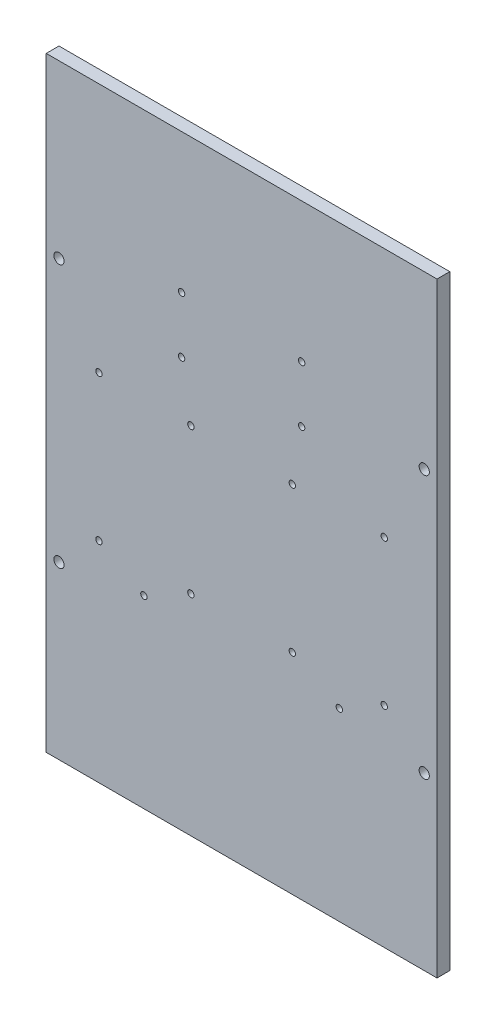
ISO-10303-21;
HEADER;
FILE_DESCRIPTION(('STEP AP214'),'2;1');
FILE_NAME('part.step','',(''),(''),'','','');
FILE_SCHEMA(('AUTOMOTIVE_DESIGN { 1 0 10303 214 1 1 1 1 }'));
ENDSEC;
DATA;
#1=APPLICATION_CONTEXT('core data for automotive mechanical design processes');
#2=APPLICATION_PROTOCOL_DEFINITION('international standard','automotive_design',2000,#1);
#3=PRODUCT_CONTEXT('',#1,'mechanical');
#4=PRODUCT('Part','Part','',(#3));
#5=PRODUCT_RELATED_PRODUCT_CATEGORY('part','',(#4));
#6=PRODUCT_DEFINITION_FORMATION('','',#4);
#7=PRODUCT_DEFINITION_CONTEXT('part definition',#1,'design');
#8=PRODUCT_DEFINITION('design','',#6,#7);
#9=PRODUCT_DEFINITION_SHAPE('','',#8);
#10=(LENGTH_UNIT() NAMED_UNIT(*) SI_UNIT(.MILLI.,.METRE.));
#11=(NAMED_UNIT(*) PLANE_ANGLE_UNIT() SI_UNIT($,.RADIAN.));
#12=(NAMED_UNIT(*) SI_UNIT($,.STERADIAN.) SOLID_ANGLE_UNIT());
#13=UNCERTAINTY_MEASURE_WITH_UNIT(LENGTH_MEASURE(1.E-05),#10,'distance_accuracy_value','');
#14=(GEOMETRIC_REPRESENTATION_CONTEXT(3) GLOBAL_UNCERTAINTY_ASSIGNED_CONTEXT((#13)) GLOBAL_UNIT_ASSIGNED_CONTEXT((#10,
#11,#12)) REPRESENTATION_CONTEXT('',''));
#15=CARTESIAN_POINT('',(0.,0.,0.));
#16=DIRECTION('',(0.,0.,1.));
#17=DIRECTION('',(1.,0.,0.));
#18=AXIS2_PLACEMENT_3D('',#15,#16,#17);
#19=CARTESIAN_POINT('',(0.,0.,5.));
#20=DIRECTION('',(1.,0.,0.));
#21=DIRECTION('',(0.,0.,-1.));
#22=AXIS2_PLACEMENT_3D('',#19,#20,#21);
#23=PLANE('',#22);
#24=DIRECTION('',(0.,-1.,0.));
#25=VECTOR('',#24,1.);
#26=CARTESIAN_POINT('',(0.,0.,0.));
#27=LINE('',#26,#25);
#28=CARTESIAN_POINT('',(0.,237.,0.));
#29=VERTEX_POINT('',#28);
#30=CARTESIAN_POINT('',(0.,0.,0.));
#31=VERTEX_POINT('',#30);
#32=EDGE_CURVE('E99',#29,#31,#27,.T.);
#33=ORIENTED_EDGE('',*,*,#32,.T.);
#34=DIRECTION('',(0.,0.,-1.));
#35=VECTOR('',#34,1.);
#36=CARTESIAN_POINT('',(0.,0.,5.));
#37=LINE('',#36,#35);
#38=CARTESIAN_POINT('',(0.,0.,5.));
#39=VERTEX_POINT('',#38);
#40=EDGE_CURVE('E11',#39,#31,#37,.T.);
#41=ORIENTED_EDGE('',*,*,#40,.F.);
#42=DIRECTION('',(0.,-1.,0.));
#43=VECTOR('',#42,1.);
#44=CARTESIAN_POINT('',(0.,0.,5.));
#45=LINE('',#44,#43);
#46=CARTESIAN_POINT('',(0.,237.,5.));
#47=VERTEX_POINT('',#46);
#48=EDGE_CURVE('E86',#47,#39,#45,.T.);
#49=ORIENTED_EDGE('',*,*,#48,.F.);
#50=DIRECTION('',(0.,0.,-1.));
#51=VECTOR('',#50,1.);
#52=CARTESIAN_POINT('',(0.,237.,5.));
#53=LINE('',#52,#51);
#54=EDGE_CURVE('E95',#47,#29,#53,.T.);
#55=ORIENTED_EDGE('',*,*,#54,.T.);
#56=EDGE_LOOP('',(#33,#41,#49,#55));
#57=FACE_BOUND('',#56,.T.);
#58=ADVANCED_FACE('F33',(#57),#23,.F.);
#59=CARTESIAN_POINT('',(0.,0.,5.));
#60=DIRECTION('',(0.,1.,0.));
#61=DIRECTION('',(0.,0.,1.));
#62=AXIS2_PLACEMENT_3D('',#59,#60,#61);
#63=PLANE('',#62);
#64=DIRECTION('',(1.,0.,0.));
#65=VECTOR('',#64,1.);
#66=CARTESIAN_POINT('',(0.,0.,0.));
#67=LINE('',#66,#65);
#68=CARTESIAN_POINT('',(153.,0.,0.));
#69=VERTEX_POINT('',#68);
#70=EDGE_CURVE('E90',#31,#69,#67,.T.);
#71=ORIENTED_EDGE('',*,*,#70,.T.);
#72=DIRECTION('',(0.,0.,-1.));
#73=VECTOR('',#72,1.);
#74=CARTESIAN_POINT('',(153.,0.,5.));
#75=LINE('',#74,#73);
#76=CARTESIAN_POINT('',(153.,0.,5.));
#77=VERTEX_POINT('',#76);
#78=EDGE_CURVE('E42',#77,#69,#75,.T.);
#79=ORIENTED_EDGE('',*,*,#78,.F.);
#80=DIRECTION('',(1.,0.,0.));
#81=VECTOR('',#80,1.);
#82=CARTESIAN_POINT('',(0.,0.,5.));
#83=LINE('',#82,#81);
#84=EDGE_CURVE('E81',#39,#77,#83,.T.);
#85=ORIENTED_EDGE('',*,*,#84,.F.);
#86=ORIENTED_EDGE('',*,*,#40,.T.);
#87=EDGE_LOOP('',(#71,#79,#85,#86));
#88=FACE_BOUND('',#87,.T.);
#89=ADVANCED_FACE('F89',(#88),#63,.F.);
#90=CARTESIAN_POINT('',(153.,0.,5.));
#91=DIRECTION('',(-1.,0.,0.));
#92=DIRECTION('',(0.,0.,1.));
#93=AXIS2_PLACEMENT_3D('',#90,#91,#92);
#94=PLANE('',#93);
#95=DIRECTION('',(0.,1.,0.));
#96=VECTOR('',#95,1.);
#97=CARTESIAN_POINT('',(153.,0.,0.));
#98=LINE('',#97,#96);
#99=CARTESIAN_POINT('',(153.,237.,0.));
#100=VERTEX_POINT('',#99);
#101=EDGE_CURVE('E68',#69,#100,#98,.T.);
#102=ORIENTED_EDGE('',*,*,#101,.T.);
#103=DIRECTION('',(0.,0.,-1.));
#104=VECTOR('',#103,1.);
#105=CARTESIAN_POINT('',(153.,237.,5.));
#106=LINE('',#105,#104);
#107=CARTESIAN_POINT('',(153.,237.,5.));
#108=VERTEX_POINT('',#107);
#109=EDGE_CURVE('E91',#108,#100,#106,.T.);
#110=ORIENTED_EDGE('',*,*,#109,.F.);
#111=DIRECTION('',(0.,1.,0.));
#112=VECTOR('',#111,1.);
#113=CARTESIAN_POINT('',(153.,0.,5.));
#114=LINE('',#113,#112);
#115=EDGE_CURVE('E84',#77,#108,#114,.T.);
#116=ORIENTED_EDGE('',*,*,#115,.F.);
#117=ORIENTED_EDGE('',*,*,#78,.T.);
#118=EDGE_LOOP('',(#102,#110,#116,#117));
#119=FACE_BOUND('',#118,.T.);
#120=ADVANCED_FACE('F93',(#119),#94,.F.);
#121=CARTESIAN_POINT('',(0.,237.,5.));
#122=DIRECTION('',(0.,-1.,0.));
#123=DIRECTION('',(0.,0.,-1.));
#124=AXIS2_PLACEMENT_3D('',#121,#122,#123);
#125=PLANE('',#124);
#126=DIRECTION('',(-1.,0.,0.));
#127=VECTOR('',#126,1.);
#128=CARTESIAN_POINT('',(0.,237.,0.));
#129=LINE('',#128,#127);
#130=EDGE_CURVE('E74',#100,#29,#129,.T.);
#131=ORIENTED_EDGE('',*,*,#130,.T.);
#132=ORIENTED_EDGE('',*,*,#54,.F.);
#133=DIRECTION('',(-1.,0.,0.));
#134=VECTOR('',#133,1.);
#135=CARTESIAN_POINT('',(0.,237.,5.));
#136=LINE('',#135,#134);
#137=EDGE_CURVE('E51',#108,#47,#136,.T.);
#138=ORIENTED_EDGE('',*,*,#137,.F.);
#139=ORIENTED_EDGE('',*,*,#109,.T.);
#140=EDGE_LOOP('',(#131,#132,#138,#139));
#141=FACE_BOUND('',#140,.T.);
#142=ADVANCED_FACE('F214',(#141),#125,.F.);
#143=CARTESIAN_POINT('',(0.,0.,5.));
#144=DIRECTION('',(0.,0.,-1.));
#145=DIRECTION('',(-1.,0.,0.));
#146=AXIS2_PLACEMENT_3D('',#143,#144,#145);
#147=PLANE('',#146);
#148=CARTESIAN_POINT('',(53.,160.458833487413,5.));
#149=DIRECTION('',(0.,0.,1.));
#150=DIRECTION('',(1.,0.,0.));
#151=AXIS2_PLACEMENT_3D('',#148,#149,#150);
#152=CIRCLE('',#151,1.25);
#153=CARTESIAN_POINT('',(54.25,160.458833487413,5.));
#154=VERTEX_POINT('',#153);
#155=EDGE_CURVE('E436',#154,#154,#152,.T.);
#156=ORIENTED_EDGE('',*,*,#155,.F.);
#157=EDGE_LOOP('',(#156));
#158=FACE_BOUND('',#157,.T.);
#159=CARTESIAN_POINT('',(100.,182.458833487413,5.));
#160=DIRECTION('',(0.,0.,1.));
#161=DIRECTION('',(1.,0.,0.));
#162=AXIS2_PLACEMENT_3D('',#159,#160,#161);
#163=CIRCLE('',#162,1.25);
#164=CARTESIAN_POINT('',(101.25,182.458833487413,5.));
#165=VERTEX_POINT('',#164);
#166=EDGE_CURVE('E437',#165,#165,#163,.T.);
#167=ORIENTED_EDGE('',*,*,#166,.F.);
#168=EDGE_LOOP('',(#167));
#169=FACE_BOUND('',#168,.T.);
#170=CARTESIAN_POINT('',(100.,160.458833487413,5.));
#171=DIRECTION('',(0.,0.,1.));
#172=DIRECTION('',(1.,0.,0.));
#173=AXIS2_PLACEMENT_3D('',#170,#171,#172);
#174=CIRCLE('',#173,1.25);
#175=CARTESIAN_POINT('',(101.25,160.458833487413,5.));
#176=VERTEX_POINT('',#175);
#177=EDGE_CURVE('E441',#176,#176,#174,.T.);
#178=ORIENTED_EDGE('',*,*,#177,.F.);
#179=EDGE_LOOP('',(#178));
#180=FACE_BOUND('',#179,.T.);
#181=CARTESIAN_POINT('',(53.,182.458833487413,5.));
#182=DIRECTION('',(0.,0.,1.));
#183=DIRECTION('',(1.,0.,0.));
#184=AXIS2_PLACEMENT_3D('',#181,#182,#183);
#185=CIRCLE('',#184,1.25);
#186=CARTESIAN_POINT('',(54.25,182.458833487413,5.));
#187=VERTEX_POINT('',#186);
#188=EDGE_CURVE('E144',#187,#187,#185,.T.);
#189=ORIENTED_EDGE('',*,*,#188,.F.);
#190=EDGE_LOOP('',(#189));
#191=FACE_BOUND('',#190,.T.);
#192=CARTESIAN_POINT('',(38.25,72.3023184178597,5.));
#193=DIRECTION('',(0.,0.,1.));
#194=DIRECTION('',(-1.,0.,0.));
#195=AXIS2_PLACEMENT_3D('',#192,#193,#194);
#196=CIRCLE('',#195,1.25);
#197=CARTESIAN_POINT('',(37.,72.3023184178597,5.));
#198=VERTEX_POINT('',#197);
#199=EDGE_CURVE('E168',#198,#198,#196,.T.);
#200=ORIENTED_EDGE('',*,*,#199,.F.);
#201=EDGE_LOOP('',(#200));
#202=FACE_BOUND('',#201,.T.);
#203=CARTESIAN_POINT('',(132.35066881281,82.0901203502536,5.));
#204=DIRECTION('',(0.,0.,1.));
#205=DIRECTION('',(1.,0.,0.));
#206=AXIS2_PLACEMENT_3D('',#203,#204,#205);
#207=CIRCLE('',#206,1.24999999999998);
#208=CARTESIAN_POINT('',(133.60066881281,82.0901203502536,5.));
#209=VERTEX_POINT('',#208);
#210=EDGE_CURVE('E166',#209,#209,#207,.T.);
#211=ORIENTED_EDGE('',*,*,#210,.F.);
#212=EDGE_LOOP('',(#211));
#213=FACE_BOUND('',#212,.T.);
#214=CARTESIAN_POINT('',(96.3506688128096,82.0901203502536,5.));
#215=DIRECTION('',(0.,0.,1.));
#216=DIRECTION('',(-1.,0.,0.));
#217=AXIS2_PLACEMENT_3D('',#214,#215,#216);
#218=CIRCLE('',#217,1.25);
#219=CARTESIAN_POINT('',(95.1006688128096,82.0901203502536,5.));
#220=VERTEX_POINT('',#219);
#221=EDGE_CURVE('E160',#220,#220,#218,.T.);
#222=ORIENTED_EDGE('',*,*,#221,.F.);
#223=EDGE_LOOP('',(#222));
#224=FACE_BOUND('',#223,.T.);
#225=CARTESIAN_POINT('',(96.3506688128096,139.090120350254,5.));
#226=DIRECTION('',(0.,0.,1.));
#227=DIRECTION('',(1.,0.,0.));
#228=AXIS2_PLACEMENT_3D('',#225,#226,#227);
#229=CIRCLE('',#228,1.25);
#230=CARTESIAN_POINT('',(97.6006688128096,139.090120350254,5.));
#231=VERTEX_POINT('',#230);
#232=EDGE_CURVE('E155',#231,#231,#229,.T.);
#233=ORIENTED_EDGE('',*,*,#232,.F.);
#234=EDGE_LOOP('',(#233));
#235=FACE_BOUND('',#234,.T.);
#236=CARTESIAN_POINT('',(20.6493311871905,82.0901203502536,5.));
#237=DIRECTION('',(0.,0.,1.));
#238=DIRECTION('',(-1.,0.,0.));
#239=AXIS2_PLACEMENT_3D('',#236,#237,#238);
#240=CIRCLE('',#239,1.25);
#241=CARTESIAN_POINT('',(19.3993311871905,82.0901203502536,5.));
#242=VERTEX_POINT('',#241);
#243=EDGE_CURVE('E171',#242,#242,#240,.T.);
#244=ORIENTED_EDGE('',*,*,#243,.F.);
#245=EDGE_LOOP('',(#244));
#246=FACE_BOUND('',#245,.T.);
#247=CARTESIAN_POINT('',(56.6493311871904,82.0901203502536,5.));
#248=DIRECTION('',(0.,0.,1.));
#249=DIRECTION('',(1.,0.,0.));
#250=AXIS2_PLACEMENT_3D('',#247,#248,#249);
#251=CIRCLE('',#250,1.25);
#252=CARTESIAN_POINT('',(57.8993311871904,82.0901203502536,5.));
#253=VERTEX_POINT('',#252);
#254=EDGE_CURVE('E180',#253,#253,#251,.T.);
#255=ORIENTED_EDGE('',*,*,#254,.F.);
#256=EDGE_LOOP('',(#255));
#257=FACE_BOUND('',#256,.T.);
#258=CARTESIAN_POINT('',(56.6493311871904,139.090120350254,5.));
#259=DIRECTION('',(0.,0.,1.));
#260=DIRECTION('',(-1.,0.,0.));
#261=AXIS2_PLACEMENT_3D('',#258,#259,#260);
#262=CIRCLE('',#261,1.25);
#263=CARTESIAN_POINT('',(55.3993311871904,139.090120350254,5.));
#264=VERTEX_POINT('',#263);
#265=EDGE_CURVE('E177',#264,#264,#262,.T.);
#266=ORIENTED_EDGE('',*,*,#265,.F.);
#267=EDGE_LOOP('',(#266));
#268=FACE_BOUND('',#267,.T.);
#269=CARTESIAN_POINT('',(20.6493311871905,139.090120350254,5.));
#270=DIRECTION('',(0.,0.,1.));
#271=DIRECTION('',(1.,0.,0.));
#272=AXIS2_PLACEMENT_3D('',#269,#270,#271);
#273=CIRCLE('',#272,1.25);
#274=CARTESIAN_POINT('',(21.8993311871905,139.090120350254,5.));
#275=VERTEX_POINT('',#274);
#276=EDGE_CURVE('E174',#275,#275,#273,.T.);
#277=ORIENTED_EDGE('',*,*,#276,.F.);
#278=EDGE_LOOP('',(#277));
#279=FACE_BOUND('',#278,.T.);
#280=CARTESIAN_POINT('',(132.35066881281,139.090120350254,5.));
#281=DIRECTION('',(0.,0.,1.));
#282=DIRECTION('',(-1.,0.,0.));
#283=AXIS2_PLACEMENT_3D('',#280,#281,#282);
#284=CIRCLE('',#283,1.24999999999998);
#285=CARTESIAN_POINT('',(131.10066881281,139.090120350254,5.));
#286=VERTEX_POINT('',#285);
#287=EDGE_CURVE('E151',#286,#286,#284,.T.);
#288=ORIENTED_EDGE('',*,*,#287,.F.);
#289=EDGE_LOOP('',(#288));
#290=FACE_BOUND('',#289,.T.);
#291=CARTESIAN_POINT('',(114.75,72.3023184178597,5.));
#292=DIRECTION('',(0.,0.,1.));
#293=DIRECTION('',(1.,0.,0.));
#294=AXIS2_PLACEMENT_3D('',#291,#292,#293);
#295=CIRCLE('',#294,1.25);
#296=CARTESIAN_POINT('',(116.,72.3023184178597,5.));
#297=VERTEX_POINT('',#296);
#298=EDGE_CURVE('E112',#297,#297,#295,.T.);
#299=ORIENTED_EDGE('',*,*,#298,.F.);
#300=EDGE_LOOP('',(#299));
#301=FACE_BOUND('',#300,.T.);
#302=CARTESIAN_POINT('',(148.,170.,5.));
#303=DIRECTION('',(0.,0.,1.));
#304=DIRECTION('',(-1.,0.,0.));
#305=AXIS2_PLACEMENT_3D('',#302,#303,#304);
#306=CIRCLE('',#305,2.);
#307=CARTESIAN_POINT('',(146.,170.,5.));
#308=VERTEX_POINT('',#307);
#309=EDGE_CURVE('E197',#308,#308,#306,.T.);
#310=ORIENTED_EDGE('',*,*,#309,.F.);
#311=EDGE_LOOP('',(#310));
#312=FACE_BOUND('',#311,.T.);
#313=CARTESIAN_POINT('',(5.00000000000001,67.,5.));
#314=DIRECTION('',(0.,0.,1.));
#315=DIRECTION('',(-1.,0.,0.));
#316=AXIS2_PLACEMENT_3D('',#313,#314,#315);
#317=CIRCLE('',#316,2.);
#318=CARTESIAN_POINT('',(3.00000000000001,67.,5.));
#319=VERTEX_POINT('',#318);
#320=EDGE_CURVE('E190',#319,#319,#317,.T.);
#321=ORIENTED_EDGE('',*,*,#320,.F.);
#322=EDGE_LOOP('',(#321));
#323=FACE_BOUND('',#322,.T.);
#324=CARTESIAN_POINT('',(148.,67.,5.));
#325=DIRECTION('',(0.,0.,1.));
#326=DIRECTION('',(1.,0.,0.));
#327=AXIS2_PLACEMENT_3D('',#324,#325,#326);
#328=CIRCLE('',#327,2.);
#329=CARTESIAN_POINT('',(150.,67.,5.));
#330=VERTEX_POINT('',#329);
#331=EDGE_CURVE('E139',#330,#330,#328,.T.);
#332=ORIENTED_EDGE('',*,*,#331,.F.);
#333=EDGE_LOOP('',(#332));
#334=FACE_BOUND('',#333,.T.);
#335=CARTESIAN_POINT('',(5.00000000000001,170.,5.));
#336=DIRECTION('',(0.,0.,1.));
#337=DIRECTION('',(1.,0.,0.));
#338=AXIS2_PLACEMENT_3D('',#335,#336,#337);
#339=CIRCLE('',#338,2.);
#340=CARTESIAN_POINT('',(7.00000000000001,170.,5.));
#341=VERTEX_POINT('',#340);
#342=EDGE_CURVE('E196',#341,#341,#339,.T.);
#343=ORIENTED_EDGE('',*,*,#342,.F.);
#344=EDGE_LOOP('',(#343));
#345=FACE_BOUND('',#344,.T.);
#346=ORIENTED_EDGE('',*,*,#48,.T.);
#347=ORIENTED_EDGE('',*,*,#84,.T.);
#348=ORIENTED_EDGE('',*,*,#115,.T.);
#349=ORIENTED_EDGE('',*,*,#137,.T.);
#350=EDGE_LOOP('',(#346,#347,#348,#349));
#351=FACE_BOUND('',#350,.T.);
#352=ADVANCED_FACE('F82',(#158,#169,#180,#191,#202,#213,#224,#235,#246,#257,#268,#279,#290,#301,
#312,#323,#334,#345,#351),#147,.F.);
#353=CARTESIAN_POINT('',(0.,0.,0.));
#354=DIRECTION('',(0.,0.,-1.));
#355=DIRECTION('',(-1.,0.,0.));
#356=AXIS2_PLACEMENT_3D('',#353,#354,#355);
#357=PLANE('',#356);
#358=CARTESIAN_POINT('',(53.,160.458833487413,0.));
#359=DIRECTION('',(0.,0.,-1.));
#360=DIRECTION('',(-1.,0.,0.));
#361=AXIS2_PLACEMENT_3D('',#358,#359,#360);
#362=CIRCLE('',#361,1.25);
#363=CARTESIAN_POINT('',(51.75,160.458833487413,0.));
#364=VERTEX_POINT('',#363);
#365=EDGE_CURVE('E36',#364,#364,#362,.T.);
#366=ORIENTED_EDGE('',*,*,#365,.F.);
#367=EDGE_LOOP('',(#366));
#368=FACE_BOUND('',#367,.T.);
#369=CARTESIAN_POINT('',(100.,182.458833487413,0.));
#370=DIRECTION('',(0.,0.,-1.));
#371=DIRECTION('',(-1.,0.,0.));
#372=AXIS2_PLACEMENT_3D('',#369,#370,#371);
#373=CIRCLE('',#372,1.25);
#374=CARTESIAN_POINT('',(98.75,182.458833487413,0.));
#375=VERTEX_POINT('',#374);
#376=EDGE_CURVE('E146',#375,#375,#373,.T.);
#377=ORIENTED_EDGE('',*,*,#376,.F.);
#378=EDGE_LOOP('',(#377));
#379=FACE_BOUND('',#378,.T.);
#380=CARTESIAN_POINT('',(100.,160.458833487413,0.));
#381=DIRECTION('',(0.,0.,-1.));
#382=DIRECTION('',(-1.,0.,0.));
#383=AXIS2_PLACEMENT_3D('',#380,#381,#382);
#384=CIRCLE('',#383,1.25);
#385=CARTESIAN_POINT('',(98.75,160.458833487413,0.));
#386=VERTEX_POINT('',#385);
#387=EDGE_CURVE('E143',#386,#386,#384,.T.);
#388=ORIENTED_EDGE('',*,*,#387,.F.);
#389=EDGE_LOOP('',(#388));
#390=FACE_BOUND('',#389,.T.);
#391=CARTESIAN_POINT('',(53.,182.458833487413,0.));
#392=DIRECTION('',(0.,0.,-1.));
#393=DIRECTION('',(-1.,0.,0.));
#394=AXIS2_PLACEMENT_3D('',#391,#392,#393);
#395=CIRCLE('',#394,1.25);
#396=CARTESIAN_POINT('',(51.75,182.458833487413,0.));
#397=VERTEX_POINT('',#396);
#398=EDGE_CURVE('E140',#397,#397,#395,.T.);
#399=ORIENTED_EDGE('',*,*,#398,.F.);
#400=EDGE_LOOP('',(#399));
#401=FACE_BOUND('',#400,.T.);
#402=CARTESIAN_POINT('',(38.25,72.3023184178597,0.));
#403=DIRECTION('',(0.,0.,-1.));
#404=DIRECTION('',(-1.,0.,0.));
#405=AXIS2_PLACEMENT_3D('',#402,#403,#404);
#406=CIRCLE('',#405,1.25);
#407=CARTESIAN_POINT('',(37.,72.3023184178597,0.));
#408=VERTEX_POINT('',#407);
#409=EDGE_CURVE('E136',#408,#408,#406,.T.);
#410=ORIENTED_EDGE('',*,*,#409,.F.);
#411=EDGE_LOOP('',(#410));
#412=FACE_BOUND('',#411,.T.);
#413=CARTESIAN_POINT('',(132.35066881281,82.0901203502536,0.));
#414=DIRECTION('',(0.,0.,-1.));
#415=DIRECTION('',(-1.,0.,0.));
#416=AXIS2_PLACEMENT_3D('',#413,#414,#415);
#417=CIRCLE('',#416,1.24999999999998);
#418=CARTESIAN_POINT('',(131.10066881281,82.0901203502536,0.));
#419=VERTEX_POINT('',#418);
#420=EDGE_CURVE('E133',#419,#419,#417,.T.);
#421=ORIENTED_EDGE('',*,*,#420,.F.);
#422=EDGE_LOOP('',(#421));
#423=FACE_BOUND('',#422,.T.);
#424=CARTESIAN_POINT('',(96.3506688128096,82.0901203502536,0.));
#425=DIRECTION('',(0.,0.,-1.));
#426=DIRECTION('',(-1.,0.,0.));
#427=AXIS2_PLACEMENT_3D('',#424,#425,#426);
#428=CIRCLE('',#427,1.25);
#429=CARTESIAN_POINT('',(95.1006688128096,82.0901203502536,0.));
#430=VERTEX_POINT('',#429);
#431=EDGE_CURVE('E130',#430,#430,#428,.T.);
#432=ORIENTED_EDGE('',*,*,#431,.F.);
#433=EDGE_LOOP('',(#432));
#434=FACE_BOUND('',#433,.T.);
#435=CARTESIAN_POINT('',(96.3506688128096,139.090120350254,0.));
#436=DIRECTION('',(0.,0.,-1.));
#437=DIRECTION('',(-1.,0.,0.));
#438=AXIS2_PLACEMENT_3D('',#435,#436,#437);
#439=CIRCLE('',#438,1.25);
#440=CARTESIAN_POINT('',(95.1006688128096,139.090120350254,0.));
#441=VERTEX_POINT('',#440);
#442=EDGE_CURVE('E127',#441,#441,#439,.T.);
#443=ORIENTED_EDGE('',*,*,#442,.F.);
#444=EDGE_LOOP('',(#443));
#445=FACE_BOUND('',#444,.T.);
#446=CARTESIAN_POINT('',(20.6493311871905,82.0901203502536,0.));
#447=DIRECTION('',(0.,0.,-1.));
#448=DIRECTION('',(-1.,0.,0.));
#449=AXIS2_PLACEMENT_3D('',#446,#447,#448);
#450=CIRCLE('',#449,1.25);
#451=CARTESIAN_POINT('',(19.3993311871905,82.0901203502536,0.));
#452=VERTEX_POINT('',#451);
#453=EDGE_CURVE('E124',#452,#452,#450,.T.);
#454=ORIENTED_EDGE('',*,*,#453,.F.);
#455=EDGE_LOOP('',(#454));
#456=FACE_BOUND('',#455,.T.);
#457=CARTESIAN_POINT('',(56.6493311871904,82.0901203502536,0.));
#458=DIRECTION('',(0.,0.,-1.));
#459=DIRECTION('',(-1.,0.,0.));
#460=AXIS2_PLACEMENT_3D('',#457,#458,#459);
#461=CIRCLE('',#460,1.25);
#462=CARTESIAN_POINT('',(55.3993311871904,82.0901203502536,0.));
#463=VERTEX_POINT('',#462);
#464=EDGE_CURVE('E121',#463,#463,#461,.T.);
#465=ORIENTED_EDGE('',*,*,#464,.F.);
#466=EDGE_LOOP('',(#465));
#467=FACE_BOUND('',#466,.T.);
#468=CARTESIAN_POINT('',(56.6493311871904,139.090120350254,0.));
#469=DIRECTION('',(0.,0.,-1.));
#470=DIRECTION('',(-1.,0.,0.));
#471=AXIS2_PLACEMENT_3D('',#468,#469,#470);
#472=CIRCLE('',#471,1.25);
#473=CARTESIAN_POINT('',(55.3993311871904,139.090120350254,0.));
#474=VERTEX_POINT('',#473);
#475=EDGE_CURVE('E118',#474,#474,#472,.T.);
#476=ORIENTED_EDGE('',*,*,#475,.F.);
#477=EDGE_LOOP('',(#476));
#478=FACE_BOUND('',#477,.T.);
#479=CARTESIAN_POINT('',(20.6493311871905,139.090120350254,0.));
#480=DIRECTION('',(0.,0.,-1.));
#481=DIRECTION('',(-1.,0.,0.));
#482=AXIS2_PLACEMENT_3D('',#479,#480,#481);
#483=CIRCLE('',#482,1.25);
#484=CARTESIAN_POINT('',(19.3993311871905,139.090120350254,0.));
#485=VERTEX_POINT('',#484);
#486=EDGE_CURVE('E115',#485,#485,#483,.T.);
#487=ORIENTED_EDGE('',*,*,#486,.F.);
#488=EDGE_LOOP('',(#487));
#489=FACE_BOUND('',#488,.T.);
#490=CARTESIAN_POINT('',(132.35066881281,139.090120350254,0.));
#491=DIRECTION('',(0.,0.,-1.));
#492=DIRECTION('',(-1.,0.,0.));
#493=AXIS2_PLACEMENT_3D('',#490,#491,#492);
#494=CIRCLE('',#493,1.24999999999998);
#495=CARTESIAN_POINT('',(131.10066881281,139.090120350254,0.));
#496=VERTEX_POINT('',#495);
#497=EDGE_CURVE('E111',#496,#496,#494,.T.);
#498=ORIENTED_EDGE('',*,*,#497,.F.);
#499=EDGE_LOOP('',(#498));
#500=FACE_BOUND('',#499,.T.);
#501=CARTESIAN_POINT('',(114.75,72.3023184178597,0.));
#502=DIRECTION('',(0.,0.,-1.));
#503=DIRECTION('',(-1.,0.,0.));
#504=AXIS2_PLACEMENT_3D('',#501,#502,#503);
#505=CIRCLE('',#504,1.25);
#506=CARTESIAN_POINT('',(113.5,72.3023184178597,0.));
#507=VERTEX_POINT('',#506);
#508=EDGE_CURVE('E108',#507,#507,#505,.T.);
#509=ORIENTED_EDGE('',*,*,#508,.F.);
#510=EDGE_LOOP('',(#509));
#511=FACE_BOUND('',#510,.T.);
#512=CARTESIAN_POINT('',(148.,170.,0.));
#513=DIRECTION('',(0.,0.,1.));
#514=DIRECTION('',(-1.,0.,0.));
#515=AXIS2_PLACEMENT_3D('',#512,#513,#514);
#516=CIRCLE('',#515,2.);
#517=CARTESIAN_POINT('',(146.,170.,0.));
#518=VERTEX_POINT('',#517);
#519=EDGE_CURVE('E193',#518,#518,#516,.T.);
#520=ORIENTED_EDGE('',*,*,#519,.T.);
#521=EDGE_LOOP('',(#520));
#522=FACE_BOUND('',#521,.T.);
#523=CARTESIAN_POINT('',(5.00000000000001,67.,0.));
#524=DIRECTION('',(0.,0.,1.));
#525=DIRECTION('',(-1.,0.,0.));
#526=AXIS2_PLACEMENT_3D('',#523,#524,#525);
#527=CIRCLE('',#526,2.);
#528=CARTESIAN_POINT('',(3.00000000000001,67.,0.));
#529=VERTEX_POINT('',#528);
#530=EDGE_CURVE('E200',#529,#529,#527,.T.);
#531=ORIENTED_EDGE('',*,*,#530,.T.);
#532=EDGE_LOOP('',(#531));
#533=FACE_BOUND('',#532,.T.);
#534=CARTESIAN_POINT('',(148.,67.,0.));
#535=DIRECTION('',(0.,0.,1.));
#536=DIRECTION('',(1.,0.,0.));
#537=AXIS2_PLACEMENT_3D('',#534,#535,#536);
#538=CIRCLE('',#537,2.);
#539=CARTESIAN_POINT('',(150.,67.,0.));
#540=VERTEX_POINT('',#539);
#541=EDGE_CURVE('E187',#540,#540,#538,.T.);
#542=ORIENTED_EDGE('',*,*,#541,.T.);
#543=EDGE_LOOP('',(#542));
#544=FACE_BOUND('',#543,.T.);
#545=CARTESIAN_POINT('',(5.00000000000001,170.,0.));
#546=DIRECTION('',(0.,0.,1.));
#547=DIRECTION('',(1.,0.,0.));
#548=AXIS2_PLACEMENT_3D('',#545,#546,#547);
#549=CIRCLE('',#548,2.);
#550=CARTESIAN_POINT('',(7.00000000000001,170.,0.));
#551=VERTEX_POINT('',#550);
#552=EDGE_CURVE('E102',#551,#551,#549,.T.);
#553=ORIENTED_EDGE('',*,*,#552,.T.);
#554=EDGE_LOOP('',(#553));
#555=FACE_BOUND('',#554,.T.);
#556=ORIENTED_EDGE('',*,*,#32,.F.);
#557=ORIENTED_EDGE('',*,*,#130,.F.);
#558=ORIENTED_EDGE('',*,*,#101,.F.);
#559=ORIENTED_EDGE('',*,*,#70,.F.);
#560=EDGE_LOOP('',(#556,#557,#558,#559));
#561=FACE_BOUND('',#560,.T.);
#562=ADVANCED_FACE('F213',(#368,#379,#390,#401,#412,#423,#434,#445,#456,#467,#478,#489,#500,
#511,#522,#533,#544,#555,#561),#357,.T.);
#563=CARTESIAN_POINT('',(5.00000000000001,170.,0.));
#564=DIRECTION('',(0.,0.,1.));
#565=DIRECTION('',(1.,0.,0.));
#566=AXIS2_PLACEMENT_3D('',#563,#564,#565);
#567=CYLINDRICAL_SURFACE('',#566,2.);
#568=ORIENTED_EDGE('',*,*,#552,.F.);
#569=EDGE_LOOP('',(#568));
#570=FACE_BOUND('',#569,.T.);
#571=ORIENTED_EDGE('',*,*,#342,.T.);
#572=EDGE_LOOP('',(#571));
#573=FACE_BOUND('',#572,.T.);
#574=ADVANCED_FACE('F210',(#570,#573),#567,.F.);
#575=CARTESIAN_POINT('',(148.,67.,0.));
#576=DIRECTION('',(0.,0.,1.));
#577=DIRECTION('',(1.,0.,0.));
#578=AXIS2_PLACEMENT_3D('',#575,#576,#577);
#579=CYLINDRICAL_SURFACE('',#578,2.);
#580=ORIENTED_EDGE('',*,*,#541,.F.);
#581=EDGE_LOOP('',(#580));
#582=FACE_BOUND('',#581,.T.);
#583=ORIENTED_EDGE('',*,*,#331,.T.);
#584=EDGE_LOOP('',(#583));
#585=FACE_BOUND('',#584,.T.);
#586=ADVANCED_FACE('F254',(#582,#585),#579,.F.);
#587=CARTESIAN_POINT('',(5.00000000000001,67.,0.));
#588=DIRECTION('',(0.,0.,1.));
#589=DIRECTION('',(1.,0.,0.));
#590=AXIS2_PLACEMENT_3D('',#587,#588,#589);
#591=CYLINDRICAL_SURFACE('',#590,2.);
#592=ORIENTED_EDGE('',*,*,#530,.F.);
#593=EDGE_LOOP('',(#592));
#594=FACE_BOUND('',#593,.T.);
#595=ORIENTED_EDGE('',*,*,#320,.T.);
#596=EDGE_LOOP('',(#595));
#597=FACE_BOUND('',#596,.T.);
#598=ADVANCED_FACE('F264',(#594,#597),#591,.F.);
#599=CARTESIAN_POINT('',(148.,170.,0.));
#600=DIRECTION('',(0.,0.,1.));
#601=DIRECTION('',(1.,0.,0.));
#602=AXIS2_PLACEMENT_3D('',#599,#600,#601);
#603=CYLINDRICAL_SURFACE('',#602,2.);
#604=ORIENTED_EDGE('',*,*,#519,.F.);
#605=EDGE_LOOP('',(#604));
#606=FACE_BOUND('',#605,.T.);
#607=ORIENTED_EDGE('',*,*,#309,.T.);
#608=EDGE_LOOP('',(#607));
#609=FACE_BOUND('',#608,.T.);
#610=ADVANCED_FACE('F274',(#606,#609),#603,.F.);
#611=CARTESIAN_POINT('',(114.75,72.3023184178597,-5.));
#612=DIRECTION('',(0.,0.,1.));
#613=DIRECTION('',(1.,0.,0.));
#614=AXIS2_PLACEMENT_3D('',#611,#612,#613);
#615=CYLINDRICAL_SURFACE('',#614,1.25);
#616=ORIENTED_EDGE('',*,*,#508,.T.);
#617=EDGE_LOOP('',(#616));
#618=FACE_BOUND('',#617,.T.);
#619=ORIENTED_EDGE('',*,*,#298,.T.);
#620=EDGE_LOOP('',(#619));
#621=FACE_BOUND('',#620,.T.);
#622=ADVANCED_FACE('F284',(#618,#621),#615,.F.);
#623=CARTESIAN_POINT('',(132.35066881281,139.090120350254,-5.));
#624=DIRECTION('',(0.,0.,1.));
#625=DIRECTION('',(1.,0.,0.));
#626=AXIS2_PLACEMENT_3D('',#623,#624,#625);
#627=CYLINDRICAL_SURFACE('',#626,1.24999999999998);
#628=ORIENTED_EDGE('',*,*,#497,.T.);
#629=EDGE_LOOP('',(#628));
#630=FACE_BOUND('',#629,.T.);
#631=ORIENTED_EDGE('',*,*,#287,.T.);
#632=EDGE_LOOP('',(#631));
#633=FACE_BOUND('',#632,.T.);
#634=ADVANCED_FACE('F294',(#630,#633),#627,.F.);
#635=CARTESIAN_POINT('',(20.6493311871905,139.090120350254,-5.));
#636=DIRECTION('',(0.,0.,1.));
#637=DIRECTION('',(1.,0.,0.));
#638=AXIS2_PLACEMENT_3D('',#635,#636,#637);
#639=CYLINDRICAL_SURFACE('',#638,1.25);
#640=ORIENTED_EDGE('',*,*,#486,.T.);
#641=EDGE_LOOP('',(#640));
#642=FACE_BOUND('',#641,.T.);
#643=ORIENTED_EDGE('',*,*,#276,.T.);
#644=EDGE_LOOP('',(#643));
#645=FACE_BOUND('',#644,.T.);
#646=ADVANCED_FACE('F304',(#642,#645),#639,.F.);
#647=CARTESIAN_POINT('',(56.6493311871904,139.090120350254,-5.));
#648=DIRECTION('',(0.,0.,1.));
#649=DIRECTION('',(1.,0.,0.));
#650=AXIS2_PLACEMENT_3D('',#647,#648,#649);
#651=CYLINDRICAL_SURFACE('',#650,1.25);
#652=ORIENTED_EDGE('',*,*,#475,.T.);
#653=EDGE_LOOP('',(#652));
#654=FACE_BOUND('',#653,.T.);
#655=ORIENTED_EDGE('',*,*,#265,.T.);
#656=EDGE_LOOP('',(#655));
#657=FACE_BOUND('',#656,.T.);
#658=ADVANCED_FACE('F314',(#654,#657),#651,.F.);
#659=CARTESIAN_POINT('',(56.6493311871904,82.0901203502536,-5.));
#660=DIRECTION('',(0.,0.,1.));
#661=DIRECTION('',(1.,0.,0.));
#662=AXIS2_PLACEMENT_3D('',#659,#660,#661);
#663=CYLINDRICAL_SURFACE('',#662,1.25);
#664=ORIENTED_EDGE('',*,*,#464,.T.);
#665=EDGE_LOOP('',(#664));
#666=FACE_BOUND('',#665,.T.);
#667=ORIENTED_EDGE('',*,*,#254,.T.);
#668=EDGE_LOOP('',(#667));
#669=FACE_BOUND('',#668,.T.);
#670=ADVANCED_FACE('F324',(#666,#669),#663,.F.);
#671=CARTESIAN_POINT('',(20.6493311871905,82.0901203502536,-5.));
#672=DIRECTION('',(0.,0.,1.));
#673=DIRECTION('',(1.,0.,0.));
#674=AXIS2_PLACEMENT_3D('',#671,#672,#673);
#675=CYLINDRICAL_SURFACE('',#674,1.25);
#676=ORIENTED_EDGE('',*,*,#453,.T.);
#677=EDGE_LOOP('',(#676));
#678=FACE_BOUND('',#677,.T.);
#679=ORIENTED_EDGE('',*,*,#243,.T.);
#680=EDGE_LOOP('',(#679));
#681=FACE_BOUND('',#680,.T.);
#682=ADVANCED_FACE('F334',(#678,#681),#675,.F.);
#683=CARTESIAN_POINT('',(96.3506688128096,139.090120350254,-5.));
#684=DIRECTION('',(0.,0.,1.));
#685=DIRECTION('',(1.,0.,0.));
#686=AXIS2_PLACEMENT_3D('',#683,#684,#685);
#687=CYLINDRICAL_SURFACE('',#686,1.25);
#688=ORIENTED_EDGE('',*,*,#442,.T.);
#689=EDGE_LOOP('',(#688));
#690=FACE_BOUND('',#689,.T.);
#691=ORIENTED_EDGE('',*,*,#232,.T.);
#692=EDGE_LOOP('',(#691));
#693=FACE_BOUND('',#692,.T.);
#694=ADVANCED_FACE('F344',(#690,#693),#687,.F.);
#695=CARTESIAN_POINT('',(96.3506688128096,82.0901203502536,-5.));
#696=DIRECTION('',(0.,0.,1.));
#697=DIRECTION('',(1.,0.,0.));
#698=AXIS2_PLACEMENT_3D('',#695,#696,#697);
#699=CYLINDRICAL_SURFACE('',#698,1.25);
#700=ORIENTED_EDGE('',*,*,#431,.T.);
#701=EDGE_LOOP('',(#700));
#702=FACE_BOUND('',#701,.T.);
#703=ORIENTED_EDGE('',*,*,#221,.T.);
#704=EDGE_LOOP('',(#703));
#705=FACE_BOUND('',#704,.T.);
#706=ADVANCED_FACE('F354',(#702,#705),#699,.F.);
#707=CARTESIAN_POINT('',(132.35066881281,82.0901203502536,-5.));
#708=DIRECTION('',(0.,0.,1.));
#709=DIRECTION('',(1.,0.,0.));
#710=AXIS2_PLACEMENT_3D('',#707,#708,#709);
#711=CYLINDRICAL_SURFACE('',#710,1.24999999999998);
#712=ORIENTED_EDGE('',*,*,#420,.T.);
#713=EDGE_LOOP('',(#712));
#714=FACE_BOUND('',#713,.T.);
#715=ORIENTED_EDGE('',*,*,#210,.T.);
#716=EDGE_LOOP('',(#715));
#717=FACE_BOUND('',#716,.T.);
#718=ADVANCED_FACE('F364',(#714,#717),#711,.F.);
#719=CARTESIAN_POINT('',(38.25,72.3023184178597,-5.));
#720=DIRECTION('',(0.,0.,1.));
#721=DIRECTION('',(1.,0.,0.));
#722=AXIS2_PLACEMENT_3D('',#719,#720,#721);
#723=CYLINDRICAL_SURFACE('',#722,1.25);
#724=ORIENTED_EDGE('',*,*,#409,.T.);
#725=EDGE_LOOP('',(#724));
#726=FACE_BOUND('',#725,.T.);
#727=ORIENTED_EDGE('',*,*,#199,.T.);
#728=EDGE_LOOP('',(#727));
#729=FACE_BOUND('',#728,.T.);
#730=ADVANCED_FACE('F374',(#726,#729),#723,.F.);
#731=CARTESIAN_POINT('',(53.,182.458833487413,-5.));
#732=DIRECTION('',(0.,0.,1.));
#733=DIRECTION('',(1.,0.,0.));
#734=AXIS2_PLACEMENT_3D('',#731,#732,#733);
#735=CYLINDRICAL_SURFACE('',#734,1.25);
#736=ORIENTED_EDGE('',*,*,#398,.T.);
#737=EDGE_LOOP('',(#736));
#738=FACE_BOUND('',#737,.T.);
#739=ORIENTED_EDGE('',*,*,#188,.T.);
#740=EDGE_LOOP('',(#739));
#741=FACE_BOUND('',#740,.T.);
#742=ADVANCED_FACE('F383',(#738,#741),#735,.F.);
#743=CARTESIAN_POINT('',(100.,160.458833487413,-5.));
#744=DIRECTION('',(0.,0.,1.));
#745=DIRECTION('',(1.,0.,0.));
#746=AXIS2_PLACEMENT_3D('',#743,#744,#745);
#747=CYLINDRICAL_SURFACE('',#746,1.25);
#748=ORIENTED_EDGE('',*,*,#387,.T.);
#749=EDGE_LOOP('',(#748));
#750=FACE_BOUND('',#749,.T.);
#751=ORIENTED_EDGE('',*,*,#177,.T.);
#752=EDGE_LOOP('',(#751));
#753=FACE_BOUND('',#752,.T.);
#754=ADVANCED_FACE('F402',(#750,#753),#747,.F.);
#755=CARTESIAN_POINT('',(100.,182.458833487413,-5.));
#756=DIRECTION('',(0.,0.,1.));
#757=DIRECTION('',(1.,0.,0.));
#758=AXIS2_PLACEMENT_3D('',#755,#756,#757);
#759=CYLINDRICAL_SURFACE('',#758,1.25);
#760=ORIENTED_EDGE('',*,*,#376,.T.);
#761=EDGE_LOOP('',(#760));
#762=FACE_BOUND('',#761,.T.);
#763=ORIENTED_EDGE('',*,*,#166,.T.);
#764=EDGE_LOOP('',(#763));
#765=FACE_BOUND('',#764,.T.);
#766=ADVANCED_FACE('F412',(#762,#765),#759,.F.);
#767=CARTESIAN_POINT('',(53.,160.458833487413,-5.));
#768=DIRECTION('',(0.,0.,1.));
#769=DIRECTION('',(1.,0.,0.));
#770=AXIS2_PLACEMENT_3D('',#767,#768,#769);
#771=CYLINDRICAL_SURFACE('',#770,1.25);
#772=ORIENTED_EDGE('',*,*,#365,.T.);
#773=EDGE_LOOP('',(#772));
#774=FACE_BOUND('',#773,.T.);
#775=ORIENTED_EDGE('',*,*,#155,.T.);
#776=EDGE_LOOP('',(#775));
#777=FACE_BOUND('',#776,.T.);
#778=ADVANCED_FACE('F422',(#774,#777),#771,.F.);
#779=CLOSED_SHELL('',(#58,#89,#120,#142,#352,#562,#574,#586,#598,#610,#622,#634,#646,#658,#670,
#682,#694,#706,#718,#730,#742,#754,#766,#778));
#780=MANIFOLD_SOLID_BREP('B2',#779);
#781=ADVANCED_BREP_SHAPE_REPRESENTATION('',(#18,#780),#14);
#782=SHAPE_DEFINITION_REPRESENTATION(#9,#781);
ENDSEC;
END-ISO-10303-21;
